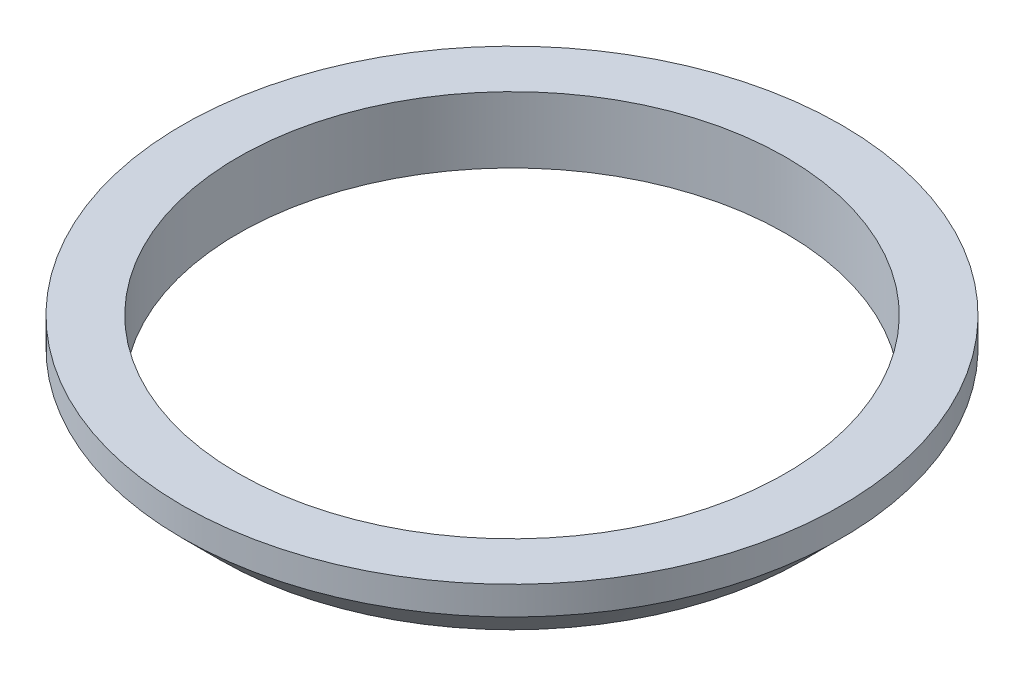
ISO-10303-21;
HEADER;
FILE_DESCRIPTION(('STEP AP214'),'2;1');
FILE_NAME('part.step','',(''),(''),'','','');
FILE_SCHEMA(('AUTOMOTIVE_DESIGN { 1 0 10303 214 1 1 1 1 }'));
ENDSEC;
DATA;
#1=APPLICATION_CONTEXT('core data for automotive mechanical design processes');
#2=APPLICATION_PROTOCOL_DEFINITION('international standard','automotive_design',2000,#1);
#3=PRODUCT_CONTEXT('',#1,'mechanical');
#4=PRODUCT('Part','Part','',(#3));
#5=PRODUCT_RELATED_PRODUCT_CATEGORY('part','',(#4));
#6=PRODUCT_DEFINITION_FORMATION('','',#4);
#7=PRODUCT_DEFINITION_CONTEXT('part definition',#1,'design');
#8=PRODUCT_DEFINITION('design','',#6,#7);
#9=PRODUCT_DEFINITION_SHAPE('','',#8);
#10=(LENGTH_UNIT() NAMED_UNIT(*) SI_UNIT(.MILLI.,.METRE.));
#11=(NAMED_UNIT(*) PLANE_ANGLE_UNIT() SI_UNIT($,.RADIAN.));
#12=(NAMED_UNIT(*) SI_UNIT($,.STERADIAN.) SOLID_ANGLE_UNIT());
#13=UNCERTAINTY_MEASURE_WITH_UNIT(LENGTH_MEASURE(1.E-05),#10,'distance_accuracy_value','');
#14=(GEOMETRIC_REPRESENTATION_CONTEXT(3) GLOBAL_UNCERTAINTY_ASSIGNED_CONTEXT((#13)) GLOBAL_UNIT_ASSIGNED_CONTEXT((#10,
#11,#12)) REPRESENTATION_CONTEXT('',''));
#15=CARTESIAN_POINT('',(0.,0.,0.));
#16=DIRECTION('',(0.,0.,1.));
#17=DIRECTION('',(1.,0.,0.));
#18=AXIS2_PLACEMENT_3D('',#15,#16,#17);
#19=CARTESIAN_POINT('',(0.,7.,0.));
#20=DIRECTION('',(0.,1.,0.));
#21=DIRECTION('',(0.,0.,1.));
#22=AXIS2_PLACEMENT_3D('',#19,#20,#21);
#23=PLANE('',#22);
#24=CARTESIAN_POINT('',(0.,7.,0.));
#25=DIRECTION('',(0.,1.,0.));
#26=DIRECTION('',(0.,0.,1.));
#27=AXIS2_PLACEMENT_3D('',#24,#25,#26);
#28=CIRCLE('',#27,34.9);
#29=CARTESIAN_POINT('',(0.,7.,34.9));
#30=VERTEX_POINT('',#29);
#31=EDGE_CURVE('E51',#30,#30,#28,.T.);
#32=ORIENTED_EDGE('',*,*,#31,.T.);
#33=EDGE_LOOP('',(#32));
#34=FACE_BOUND('',#33,.T.);
#35=CARTESIAN_POINT('',(0.,7.,0.));
#36=DIRECTION('',(0.,1.,0.));
#37=DIRECTION('',(0.,0.,1.));
#38=AXIS2_PLACEMENT_3D('',#35,#36,#37);
#39=CIRCLE('',#38,29.);
#40=CARTESIAN_POINT('',(0.,7.,29.));
#41=VERTEX_POINT('',#40);
#42=EDGE_CURVE('E56',#41,#41,#39,.T.);
#43=ORIENTED_EDGE('',*,*,#42,.F.);
#44=EDGE_LOOP('',(#43));
#45=FACE_BOUND('',#44,.T.);
#46=ADVANCED_FACE('F38',(#34,#45),#23,.T.);
#47=CARTESIAN_POINT('',(0.,0.,0.));
#48=DIRECTION('',(0.,1.,0.));
#49=DIRECTION('',(0.,0.,1.));
#50=AXIS2_PLACEMENT_3D('',#47,#48,#49);
#51=PLANE('',#50);
#52=CARTESIAN_POINT('',(0.,0.,0.));
#53=DIRECTION('',(0.,1.,0.));
#54=DIRECTION('',(0.,0.,1.));
#55=AXIS2_PLACEMENT_3D('',#52,#53,#54);
#56=CIRCLE('',#55,30.9);
#57=CARTESIAN_POINT('',(0.,0.,30.9));
#58=VERTEX_POINT('',#57);
#59=EDGE_CURVE('E10',#58,#58,#56,.F.);
#60=ORIENTED_EDGE('',*,*,#59,.T.);
#61=EDGE_LOOP('',(#60));
#62=FACE_BOUND('',#61,.T.);
#63=CARTESIAN_POINT('',(0.,0.,0.));
#64=DIRECTION('',(0.,1.,0.));
#65=DIRECTION('',(0.,0.,1.));
#66=AXIS2_PLACEMENT_3D('',#63,#64,#65);
#67=CIRCLE('',#66,29.);
#68=CARTESIAN_POINT('',(0.,0.,29.));
#69=VERTEX_POINT('',#68);
#70=EDGE_CURVE('E59',#69,#69,#67,.T.);
#71=ORIENTED_EDGE('',*,*,#70,.T.);
#72=EDGE_LOOP('',(#71));
#73=FACE_BOUND('',#72,.T.);
#74=ADVANCED_FACE('F71',(#62,#73),#51,.F.);
#75=CARTESIAN_POINT('',(0.,7.,0.));
#76=DIRECTION('',(0.,-1.,0.));
#77=DIRECTION('',(0.,0.,-1.));
#78=AXIS2_PLACEMENT_3D('',#75,#76,#77);
#79=CYLINDRICAL_SURFACE('',#78,34.9);
#80=CARTESIAN_POINT('',(0.,4.,0.));
#81=DIRECTION('',(0.,1.,0.));
#82=DIRECTION('',(0.,0.,1.));
#83=AXIS2_PLACEMENT_3D('',#80,#81,#82);
#84=CIRCLE('',#83,34.9);
#85=CARTESIAN_POINT('',(0.,4.,34.9));
#86=VERTEX_POINT('',#85);
#87=EDGE_CURVE('E46',#86,#86,#84,.T.);
#88=ORIENTED_EDGE('',*,*,#87,.T.);
#89=EDGE_LOOP('',(#88));
#90=FACE_BOUND('',#89,.T.);
#91=ORIENTED_EDGE('',*,*,#31,.F.);
#92=EDGE_LOOP('',(#91));
#93=FACE_BOUND('',#92,.T.);
#94=ADVANCED_FACE('F77',(#90,#93),#79,.T.);
#95=CARTESIAN_POINT('',(0.,7.,0.));
#96=DIRECTION('',(0.,-1.,0.));
#97=DIRECTION('',(0.,0.,-1.));
#98=AXIS2_PLACEMENT_3D('',#95,#96,#97);
#99=CYLINDRICAL_SURFACE('',#98,29.);
#100=ORIENTED_EDGE('',*,*,#42,.T.);
#101=EDGE_LOOP('',(#100));
#102=FACE_BOUND('',#101,.T.);
#103=ORIENTED_EDGE('',*,*,#70,.F.);
#104=EDGE_LOOP('',(#103));
#105=FACE_BOUND('',#104,.T.);
#106=ADVANCED_FACE('F67',(#102,#105),#99,.F.);
#107=CARTESIAN_POINT('',(0.,4.,0.));
#108=DIRECTION('',(0.,1.,0.));
#109=DIRECTION('',(0.,0.,1.));
#110=AXIS2_PLACEMENT_3D('',#107,#108,#109);
#111=CONICAL_SURFACE('',#110,34.9,0.785398163397447);
#112=ORIENTED_EDGE('',*,*,#59,.F.);
#113=EDGE_LOOP('',(#112));
#114=FACE_BOUND('',#113,.T.);
#115=ORIENTED_EDGE('',*,*,#87,.F.);
#116=EDGE_LOOP('',(#115));
#117=FACE_BOUND('',#116,.T.);
#118=ADVANCED_FACE('F40',(#114,#117),#111,.T.);
#119=CLOSED_SHELL('',(#46,#74,#94,#106,#118));
#120=MANIFOLD_SOLID_BREP('B2',#119);
#121=ADVANCED_BREP_SHAPE_REPRESENTATION('',(#18,#120),#14);
#122=SHAPE_DEFINITION_REPRESENTATION(#9,#121);
ENDSEC;
END-ISO-10303-21;
